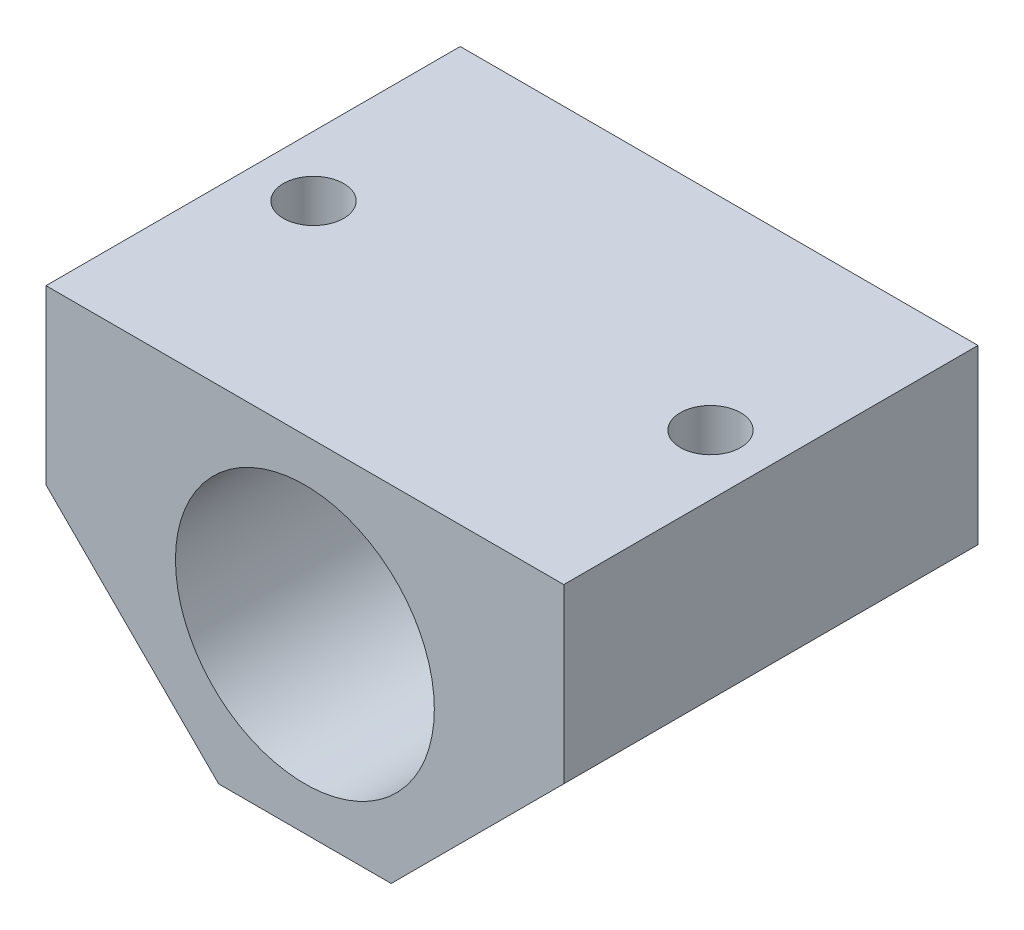
ISO-10303-21;
HEADER;
FILE_DESCRIPTION(('STEP AP214'),'2;1');
FILE_NAME('part.step','',(''),(''),'','','');
FILE_SCHEMA(('AUTOMOTIVE_DESIGN { 1 0 10303 214 1 1 1 1 }'));
ENDSEC;
DATA;
#1=APPLICATION_CONTEXT('core data for automotive mechanical design processes');
#2=APPLICATION_PROTOCOL_DEFINITION('international standard','automotive_design',2000,#1);
#3=PRODUCT_CONTEXT('',#1,'mechanical');
#4=PRODUCT('Part','Part','',(#3));
#5=PRODUCT_RELATED_PRODUCT_CATEGORY('part','',(#4));
#6=PRODUCT_DEFINITION_FORMATION('','',#4);
#7=PRODUCT_DEFINITION_CONTEXT('part definition',#1,'design');
#8=PRODUCT_DEFINITION('design','',#6,#7);
#9=PRODUCT_DEFINITION_SHAPE('','',#8);
#10=(LENGTH_UNIT() NAMED_UNIT(*) SI_UNIT(.MILLI.,.METRE.));
#11=(NAMED_UNIT(*) PLANE_ANGLE_UNIT() SI_UNIT($,.RADIAN.));
#12=(NAMED_UNIT(*) SI_UNIT($,.STERADIAN.) SOLID_ANGLE_UNIT());
#13=UNCERTAINTY_MEASURE_WITH_UNIT(LENGTH_MEASURE(1.E-05),#10,'distance_accuracy_value','');
#14=(GEOMETRIC_REPRESENTATION_CONTEXT(3) GLOBAL_UNCERTAINTY_ASSIGNED_CONTEXT((#13)) GLOBAL_UNIT_ASSIGNED_CONTEXT((#10,
#11,#12)) REPRESENTATION_CONTEXT('',''));
#15=CARTESIAN_POINT('',(0.,0.,0.));
#16=DIRECTION('',(0.,0.,1.));
#17=DIRECTION('',(1.,0.,0.));
#18=AXIS2_PLACEMENT_3D('',#15,#16,#17);
#19=CARTESIAN_POINT('',(0.,0.,24.));
#20=DIRECTION('',(0.,0.,-1.));
#21=DIRECTION('',(-1.,0.,0.));
#22=AXIS2_PLACEMENT_3D('',#19,#20,#21);
#23=PLANE('',#22);
#24=DIRECTION('',(-1.,0.,0.));
#25=VECTOR('',#24,1.);
#26=CARTESIAN_POINT('',(-30.,10.,24.));
#27=LINE('',#26,#25);
#28=CARTESIAN_POINT('',(0.,10.,24.));
#29=VERTEX_POINT('',#28);
#30=CARTESIAN_POINT('',(-30.,10.,24.));
#31=VERTEX_POINT('',#30);
#32=EDGE_CURVE('E242',#29,#31,#27,.T.);
#33=ORIENTED_EDGE('',*,*,#32,.T.);
#34=DIRECTION('',(0.,-1.,0.));
#35=VECTOR('',#34,1.);
#36=CARTESIAN_POINT('',(-30.,0.,24.));
#37=LINE('',#36,#35);
#38=CARTESIAN_POINT('',(-30.,0.,24.));
#39=VERTEX_POINT('',#38);
#40=EDGE_CURVE('E245',#31,#39,#37,.T.);
#41=ORIENTED_EDGE('',*,*,#40,.T.);
#42=DIRECTION('',(0.707106781186548,-0.707106781186547,0.));
#43=VECTOR('',#42,1.);
#44=CARTESIAN_POINT('',(-20.,-10.,24.));
#45=LINE('',#44,#43);
#46=CARTESIAN_POINT('',(-20.,-10.,24.));
#47=VERTEX_POINT('',#46);
#48=EDGE_CURVE('E248',#39,#47,#45,.T.);
#49=ORIENTED_EDGE('',*,*,#48,.T.);
#50=DIRECTION('',(1.,0.,0.));
#51=VECTOR('',#50,1.);
#52=CARTESIAN_POINT('',(-10.,-10.,24.));
#53=LINE('',#52,#51);
#54=CARTESIAN_POINT('',(-10.,-10.,24.));
#55=VERTEX_POINT('',#54);
#56=EDGE_CURVE('E250',#47,#55,#53,.T.);
#57=ORIENTED_EDGE('',*,*,#56,.T.);
#58=DIRECTION('',(0.707106781186548,0.707106781186548,0.));
#59=VECTOR('',#58,1.);
#60=CARTESIAN_POINT('',(0.,0.,24.));
#61=LINE('',#60,#59);
#62=CARTESIAN_POINT('',(0.,0.,24.));
#63=VERTEX_POINT('',#62);
#64=EDGE_CURVE('E252',#55,#63,#61,.T.);
#65=ORIENTED_EDGE('',*,*,#64,.T.);
#66=DIRECTION('',(0.,1.,0.));
#67=VECTOR('',#66,1.);
#68=CARTESIAN_POINT('',(0.,10.,24.));
#69=LINE('',#68,#67);
#70=EDGE_CURVE('E254',#63,#29,#69,.T.);
#71=ORIENTED_EDGE('',*,*,#70,.T.);
#72=EDGE_LOOP('',(#33,#41,#49,#57,#65,#71));
#73=FACE_BOUND('',#72,.T.);
#74=CARTESIAN_POINT('',(-15.,0.,24.));
#75=DIRECTION('',(0.,0.,1.));
#76=DIRECTION('',(1.,0.,0.));
#77=AXIS2_PLACEMENT_3D('',#74,#75,#76);
#78=CIRCLE('',#77,7.5);
#79=CARTESIAN_POINT('',(-7.5,0.,24.));
#80=VERTEX_POINT('',#79);
#81=EDGE_CURVE('E236',#80,#80,#78,.T.);
#82=ORIENTED_EDGE('',*,*,#81,.F.);
#83=EDGE_LOOP('',(#82));
#84=FACE_BOUND('',#83,.T.);
#85=ADVANCED_FACE('F33',(#73,#84),#23,.F.);
#86=CARTESIAN_POINT('',(0.,0.,0.));
#87=DIRECTION('',(0.,0.,-1.));
#88=DIRECTION('',(-1.,0.,0.));
#89=AXIS2_PLACEMENT_3D('',#86,#87,#88);
#90=PLANE('',#89);
#91=DIRECTION('',(-1.,0.,0.));
#92=VECTOR('',#91,1.);
#93=CARTESIAN_POINT('',(-30.,10.,0.));
#94=LINE('',#93,#92);
#95=CARTESIAN_POINT('',(0.,10.,0.));
#96=VERTEX_POINT('',#95);
#97=CARTESIAN_POINT('',(-30.,10.,0.));
#98=VERTEX_POINT('',#97);
#99=EDGE_CURVE('E239',#96,#98,#94,.T.);
#100=ORIENTED_EDGE('',*,*,#99,.F.);
#101=DIRECTION('',(0.,1.,0.));
#102=VECTOR('',#101,1.);
#103=CARTESIAN_POINT('',(0.,10.,0.));
#104=LINE('',#103,#102);
#105=CARTESIAN_POINT('',(0.,0.,0.));
#106=VERTEX_POINT('',#105);
#107=EDGE_CURVE('E246',#106,#96,#104,.T.);
#108=ORIENTED_EDGE('',*,*,#107,.F.);
#109=DIRECTION('',(0.707106781186548,0.707106781186548,0.));
#110=VECTOR('',#109,1.);
#111=CARTESIAN_POINT('',(0.,0.,0.));
#112=LINE('',#111,#110);
#113=CARTESIAN_POINT('',(-10.,-10.,0.));
#114=VERTEX_POINT('',#113);
#115=EDGE_CURVE('E265',#114,#106,#112,.T.);
#116=ORIENTED_EDGE('',*,*,#115,.F.);
#117=DIRECTION('',(1.,0.,0.));
#118=VECTOR('',#117,1.);
#119=CARTESIAN_POINT('',(-10.,-10.,0.));
#120=LINE('',#119,#118);
#121=CARTESIAN_POINT('',(-20.,-10.,0.));
#122=VERTEX_POINT('',#121);
#123=EDGE_CURVE('E263',#122,#114,#120,.T.);
#124=ORIENTED_EDGE('',*,*,#123,.F.);
#125=DIRECTION('',(0.707106781186548,-0.707106781186547,0.));
#126=VECTOR('',#125,1.);
#127=CARTESIAN_POINT('',(-20.,-10.,0.));
#128=LINE('',#127,#126);
#129=CARTESIAN_POINT('',(-30.,0.,0.));
#130=VERTEX_POINT('',#129);
#131=EDGE_CURVE('E261',#130,#122,#128,.T.);
#132=ORIENTED_EDGE('',*,*,#131,.F.);
#133=DIRECTION('',(0.,-1.,0.));
#134=VECTOR('',#133,1.);
#135=CARTESIAN_POINT('',(-30.,0.,0.));
#136=LINE('',#135,#134);
#137=EDGE_CURVE('E259',#98,#130,#136,.T.);
#138=ORIENTED_EDGE('',*,*,#137,.F.);
#139=EDGE_LOOP('',(#100,#108,#116,#124,#132,#138));
#140=FACE_BOUND('',#139,.T.);
#141=CARTESIAN_POINT('',(-15.,0.,0.));
#142=DIRECTION('',(0.,0.,1.));
#143=DIRECTION('',(1.,0.,0.));
#144=AXIS2_PLACEMENT_3D('',#141,#142,#143);
#145=CIRCLE('',#144,7.5);
#146=CARTESIAN_POINT('',(-7.5,0.,0.));
#147=VERTEX_POINT('',#146);
#148=EDGE_CURVE('E235',#147,#147,#145,.T.);
#149=ORIENTED_EDGE('',*,*,#148,.T.);
#150=EDGE_LOOP('',(#149));
#151=FACE_BOUND('',#150,.T.);
#152=ADVANCED_FACE('F341',(#140,#151),#90,.T.);
#153=CARTESIAN_POINT('',(-30.,10.,24.));
#154=DIRECTION('',(0.,-1.,0.));
#155=DIRECTION('',(0.,0.,-1.));
#156=AXIS2_PLACEMENT_3D('',#153,#154,#155);
#157=PLANE('',#156);
#158=CARTESIAN_POINT('',(-3.5,10.,12.));
#159=DIRECTION('',(0.,1.,0.));
#160=DIRECTION('',(0.,0.,1.));
#161=AXIS2_PLACEMENT_3D('',#158,#159,#160);
#162=CIRCLE('',#161,1.75);
#163=CARTESIAN_POINT('',(-3.5,10.,13.75));
#164=VERTEX_POINT('',#163);
#165=EDGE_CURVE('E229',#164,#164,#162,.T.);
#166=ORIENTED_EDGE('',*,*,#165,.F.);
#167=EDGE_LOOP('',(#166));
#168=FACE_BOUND('',#167,.T.);
#169=CARTESIAN_POINT('',(-26.5,10.,12.));
#170=DIRECTION('',(0.,1.,0.));
#171=DIRECTION('',(0.,0.,1.));
#172=AXIS2_PLACEMENT_3D('',#169,#170,#171);
#173=CIRCLE('',#172,1.75);
#174=CARTESIAN_POINT('',(-26.5,10.,13.75));
#175=VERTEX_POINT('',#174);
#176=EDGE_CURVE('E232',#175,#175,#173,.T.);
#177=ORIENTED_EDGE('',*,*,#176,.F.);
#178=EDGE_LOOP('',(#177));
#179=FACE_BOUND('',#178,.T.);
#180=ORIENTED_EDGE('',*,*,#99,.T.);
#181=DIRECTION('',(0.,0.,-1.));
#182=VECTOR('',#181,1.);
#183=CARTESIAN_POINT('',(-30.,10.,24.));
#184=LINE('',#183,#182);
#185=EDGE_CURVE('E282',#31,#98,#184,.T.);
#186=ORIENTED_EDGE('',*,*,#185,.F.);
#187=ORIENTED_EDGE('',*,*,#32,.F.);
#188=DIRECTION('',(0.,0.,-1.));
#189=VECTOR('',#188,1.);
#190=CARTESIAN_POINT('',(0.,10.,24.));
#191=LINE('',#190,#189);
#192=EDGE_CURVE('E256',#29,#96,#191,.T.);
#193=ORIENTED_EDGE('',*,*,#192,.T.);
#194=EDGE_LOOP('',(#180,#186,#187,#193));
#195=FACE_BOUND('',#194,.T.);
#196=ADVANCED_FACE('F35',(#168,#179,#195),#157,.F.);
#197=CARTESIAN_POINT('',(-30.,0.,24.));
#198=DIRECTION('',(1.,0.,0.));
#199=DIRECTION('',(0.,0.,-1.));
#200=AXIS2_PLACEMENT_3D('',#197,#198,#199);
#201=PLANE('',#200);
#202=ORIENTED_EDGE('',*,*,#137,.T.);
#203=DIRECTION('',(0.,0.,-1.));
#204=VECTOR('',#203,1.);
#205=CARTESIAN_POINT('',(-30.,0.,24.));
#206=LINE('',#205,#204);
#207=EDGE_CURVE('E279',#39,#130,#206,.T.);
#208=ORIENTED_EDGE('',*,*,#207,.F.);
#209=ORIENTED_EDGE('',*,*,#40,.F.);
#210=ORIENTED_EDGE('',*,*,#185,.T.);
#211=EDGE_LOOP('',(#202,#208,#209,#210));
#212=FACE_BOUND('',#211,.T.);
#213=ADVANCED_FACE('F367',(#212),#201,.F.);
#214=CARTESIAN_POINT('',(-20.,-10.,24.));
#215=DIRECTION('',(0.707106781186547,0.707106781186548,0.));
#216=DIRECTION('',(-0.707106781186548,0.707106781186547,0.));
#217=AXIS2_PLACEMENT_3D('',#214,#215,#216);
#218=PLANE('',#217);
#219=DIRECTION('',(0.,0.,1.));
#220=VECTOR('',#219,1.);
#221=CARTESIAN_POINT('',(-29.25,-0.749999999999982,24.));
#222=LINE('',#221,#220);
#223=CARTESIAN_POINT('',(-29.25,-0.749999999999997,10.4122867597285));
#224=VERTEX_POINT('',#223);
#225=CARTESIAN_POINT('',(-29.25,-0.749999999999995,13.5877132402715));
#226=VERTEX_POINT('',#225);
#227=EDGE_CURVE('E41',#224,#226,#222,.T.);
#228=ORIENTED_EDGE('',*,*,#227,.T.);
#229=DIRECTION('',(0.654653670707977,-0.654653670707977,0.377964473009227));
#230=VECTOR('',#229,1.);
#231=CARTESIAN_POINT('',(-18.7450557584533,-11.2549442415466,19.6527456259504));
#232=LINE('',#231,#230);
#233=CARTESIAN_POINT('',(-26.5,-3.5,15.1754264805429));
#234=VERTEX_POINT('',#233);
#235=EDGE_CURVE('E11',#226,#234,#232,.T.);
#236=ORIENTED_EDGE('',*,*,#235,.T.);
#237=DIRECTION('',(0.654653670707977,-0.654653670707977,-0.377964473009227));
#238=VECTOR('',#237,1.);
#239=CARTESIAN_POINT('',(-23.1120870986895,-6.8879129013105,13.2194140549803));
#240=LINE('',#239,#238);
#241=CARTESIAN_POINT('',(-23.75,-6.25,13.5877132402715));
#242=VERTEX_POINT('',#241);
#243=EDGE_CURVE('E161',#234,#242,#240,.T.);
#244=ORIENTED_EDGE('',*,*,#243,.T.);
#245=DIRECTION('',(0.,0.,-1.));
#246=VECTOR('',#245,1.);
#247=CARTESIAN_POINT('',(-23.75,-6.25000000000001,24.));
#248=LINE('',#247,#246);
#249=CARTESIAN_POINT('',(-23.75,-6.25,10.4122867597285));
#250=VERTEX_POINT('',#249);
#251=EDGE_CURVE('E308',#242,#250,#248,.T.);
#252=ORIENTED_EDGE('',*,*,#251,.T.);
#253=DIRECTION('',(-0.654653670707977,0.654653670707977,-0.377964473009227));
#254=VECTOR('',#253,1.);
#255=CARTESIAN_POINT('',(-17.1736271870248,-12.8263728129752,14.2091573735911));
#256=LINE('',#255,#254);
#257=CARTESIAN_POINT('',(-26.5,-3.5,8.82457351945706));
#258=VERTEX_POINT('',#257);
#259=EDGE_CURVE('E311',#250,#258,#256,.T.);
#260=ORIENTED_EDGE('',*,*,#259,.T.);
#261=DIRECTION('',(-0.654653670707977,0.654653670707977,0.377964473009227));
#262=VECTOR('',#261,1.);
#263=CARTESIAN_POINT('',(-24.6835156701181,-5.31648432988193,7.77582580262099));
#264=LINE('',#263,#262);
#265=EDGE_CURVE('E314',#258,#224,#264,.T.);
#266=ORIENTED_EDGE('',*,*,#265,.T.);
#267=EDGE_LOOP('',(#228,#236,#244,#252,#260,#266));
#268=FACE_BOUND('',#267,.T.);
#269=ORIENTED_EDGE('',*,*,#131,.T.);
#270=DIRECTION('',(0.,0.,-1.));
#271=VECTOR('',#270,1.);
#272=CARTESIAN_POINT('',(-20.,-10.,24.));
#273=LINE('',#272,#271);
#274=EDGE_CURVE('E276',#47,#122,#273,.T.);
#275=ORIENTED_EDGE('',*,*,#274,.F.);
#276=ORIENTED_EDGE('',*,*,#48,.F.);
#277=ORIENTED_EDGE('',*,*,#207,.T.);
#278=EDGE_LOOP('',(#269,#275,#276,#277));
#279=FACE_BOUND('',#278,.T.);
#280=ADVANCED_FACE('F318',(#268,#279),#218,.F.);
#281=CARTESIAN_POINT('',(-10.,-10.,24.));
#282=DIRECTION('',(0.,1.,0.));
#283=DIRECTION('',(0.,0.,1.));
#284=AXIS2_PLACEMENT_3D('',#281,#282,#283);
#285=PLANE('',#284);
#286=ORIENTED_EDGE('',*,*,#123,.T.);
#287=DIRECTION('',(0.,0.,-1.));
#288=VECTOR('',#287,1.);
#289=CARTESIAN_POINT('',(-10.,-10.,24.));
#290=LINE('',#289,#288);
#291=EDGE_CURVE('E273',#55,#114,#290,.T.);
#292=ORIENTED_EDGE('',*,*,#291,.F.);
#293=ORIENTED_EDGE('',*,*,#56,.F.);
#294=ORIENTED_EDGE('',*,*,#274,.T.);
#295=EDGE_LOOP('',(#286,#292,#293,#294));
#296=FACE_BOUND('',#295,.T.);
#297=ADVANCED_FACE('F361',(#296),#285,.F.);
#298=CARTESIAN_POINT('',(0.,0.,24.));
#299=DIRECTION('',(-0.707106781186547,0.707106781186547,0.));
#300=DIRECTION('',(-0.707106781186548,-0.707106781186548,0.));
#301=AXIS2_PLACEMENT_3D('',#298,#299,#300);
#302=PLANE('',#301);
#303=DIRECTION('',(0.,0.,1.));
#304=VECTOR('',#303,1.);
#305=CARTESIAN_POINT('',(-6.25,-6.25,24.));
#306=LINE('',#305,#304);
#307=CARTESIAN_POINT('',(-6.25,-6.25,10.4122867597285));
#308=VERTEX_POINT('',#307);
#309=CARTESIAN_POINT('',(-6.25,-6.25,13.5877132402715));
#310=VERTEX_POINT('',#309);
#311=EDGE_CURVE('E299',#308,#310,#306,.T.);
#312=ORIENTED_EDGE('',*,*,#311,.T.);
#313=DIRECTION('',(0.654653670707977,0.654653670707977,0.377964473009228));
#314=VECTOR('',#313,1.);
#315=CARTESIAN_POINT('',(1.68351567011808,1.68351567011808,18.1681306480343));
#316=LINE('',#315,#314);
#317=CARTESIAN_POINT('',(-3.5,-3.5,15.1754264805429));
#318=VERTEX_POINT('',#317);
#319=EDGE_CURVE('E302',#310,#318,#316,.T.);
#320=ORIENTED_EDGE('',*,*,#319,.T.);
#321=DIRECTION('',(0.654653670707977,0.654653670707977,-0.377964473009227));
#322=VECTOR('',#321,1.);
#323=CARTESIAN_POINT('',(-2.68351567011808,-2.68351567011808,14.7040290328965));
#324=LINE('',#323,#322);
#325=CARTESIAN_POINT('',(-0.75,-0.75,13.5877132402715));
#326=VERTEX_POINT('',#325);
#327=EDGE_CURVE('E285',#318,#326,#324,.T.);
#328=ORIENTED_EDGE('',*,*,#327,.T.);
#329=DIRECTION('',(0.,0.,-1.));
#330=VECTOR('',#329,1.);
#331=CARTESIAN_POINT('',(-0.749999999999998,-0.749999999999998,24.));
#332=LINE('',#331,#330);
#333=CARTESIAN_POINT('',(-0.75,-0.75,10.4122867597285));
#334=VERTEX_POINT('',#333);
#335=EDGE_CURVE('E290',#326,#334,#332,.T.);
#336=ORIENTED_EDGE('',*,*,#335,.T.);
#337=DIRECTION('',(-0.654653670707977,-0.654653670707977,-0.377964473009227));
#338=VECTOR('',#337,1.);
#339=CARTESIAN_POINT('',(3.25494424154665,3.25494424154665,12.7245423956749));
#340=LINE('',#339,#338);
#341=CARTESIAN_POINT('',(-3.5,-3.5,8.82457351945706));
#342=VERTEX_POINT('',#341);
#343=EDGE_CURVE('E293',#334,#342,#340,.T.);
#344=ORIENTED_EDGE('',*,*,#343,.T.);
#345=DIRECTION('',(-0.654653670707977,-0.654653670707977,0.377964473009227));
#346=VECTOR('',#345,1.);
#347=CARTESIAN_POINT('',(-4.25494424154665,-4.25494424154665,9.26044078053717));
#348=LINE('',#347,#346);
#349=EDGE_CURVE('E296',#342,#308,#348,.T.);
#350=ORIENTED_EDGE('',*,*,#349,.T.);
#351=EDGE_LOOP('',(#312,#320,#328,#336,#344,#350));
#352=FACE_BOUND('',#351,.T.);
#353=ORIENTED_EDGE('',*,*,#115,.T.);
#354=DIRECTION('',(0.,0.,-1.));
#355=VECTOR('',#354,1.);
#356=CARTESIAN_POINT('',(0.,0.,24.));
#357=LINE('',#356,#355);
#358=EDGE_CURVE('E270',#63,#106,#357,.T.);
#359=ORIENTED_EDGE('',*,*,#358,.F.);
#360=ORIENTED_EDGE('',*,*,#64,.F.);
#361=ORIENTED_EDGE('',*,*,#291,.T.);
#362=EDGE_LOOP('',(#353,#359,#360,#361));
#363=FACE_BOUND('',#362,.T.);
#364=ADVANCED_FACE('F357',(#352,#363),#302,.F.);
#365=CARTESIAN_POINT('',(0.,10.,24.));
#366=DIRECTION('',(-1.,0.,0.));
#367=DIRECTION('',(0.,-1.,0.));
#368=AXIS2_PLACEMENT_3D('',#365,#366,#367);
#369=PLANE('',#368);
#370=ORIENTED_EDGE('',*,*,#107,.T.);
#371=ORIENTED_EDGE('',*,*,#192,.F.);
#372=ORIENTED_EDGE('',*,*,#70,.F.);
#373=ORIENTED_EDGE('',*,*,#358,.T.);
#374=EDGE_LOOP('',(#370,#371,#372,#373));
#375=FACE_BOUND('',#374,.T.);
#376=ADVANCED_FACE('F354',(#375),#369,.F.);
#377=CARTESIAN_POINT('',(-15.,0.,24.));
#378=DIRECTION('',(0.,0.,-1.));
#379=DIRECTION('',(-1.,0.,0.));
#380=AXIS2_PLACEMENT_3D('',#377,#378,#379);
#381=CYLINDRICAL_SURFACE('',#380,7.5);
#382=ORIENTED_EDGE('',*,*,#81,.T.);
#383=EDGE_LOOP('',(#382));
#384=FACE_BOUND('',#383,.T.);
#385=ORIENTED_EDGE('',*,*,#148,.F.);
#386=EDGE_LOOP('',(#385));
#387=FACE_BOUND('',#386,.T.);
#388=ADVANCED_FACE('F351',(#384,#387),#381,.F.);
#389=CARTESIAN_POINT('',(-26.5,-14.,12.));
#390=DIRECTION('',(0.,1.,0.));
#391=DIRECTION('',(0.,0.,1.));
#392=AXIS2_PLACEMENT_3D('',#389,#390,#391);
#393=CYLINDRICAL_SURFACE('',#392,1.75);
#394=CARTESIAN_POINT('',(-26.5,0.,12.));
#395=DIRECTION('',(0.,1.,0.));
#396=DIRECTION('',(0.,0.,1.));
#397=AXIS2_PLACEMENT_3D('',#394,#395,#396);
#398=CIRCLE('',#397,1.75);
#399=CARTESIAN_POINT('',(-26.5,0.,13.75));
#400=VERTEX_POINT('',#399);
#401=EDGE_CURVE('E192',#400,#400,#398,.F.);
#402=ORIENTED_EDGE('',*,*,#401,.T.);
#403=EDGE_LOOP('',(#402));
#404=FACE_BOUND('',#403,.T.);
#405=ORIENTED_EDGE('',*,*,#176,.T.);
#406=EDGE_LOOP('',(#405));
#407=FACE_BOUND('',#406,.T.);
#408=ADVANCED_FACE('F396',(#404,#407),#393,.F.);
#409=CARTESIAN_POINT('',(-3.5,-14.,12.));
#410=DIRECTION('',(0.,1.,0.));
#411=DIRECTION('',(0.,0.,1.));
#412=AXIS2_PLACEMENT_3D('',#409,#410,#411);
#413=CYLINDRICAL_SURFACE('',#412,1.75);
#414=CARTESIAN_POINT('',(-3.5,0.,12.));
#415=DIRECTION('',(0.,1.,0.));
#416=DIRECTION('',(0.,0.,1.));
#417=AXIS2_PLACEMENT_3D('',#414,#415,#416);
#418=CIRCLE('',#417,1.75);
#419=CARTESIAN_POINT('',(-3.5,0.,13.75));
#420=VERTEX_POINT('',#419);
#421=EDGE_CURVE('E220',#420,#420,#418,.F.);
#422=ORIENTED_EDGE('',*,*,#421,.T.);
#423=EDGE_LOOP('',(#422));
#424=FACE_BOUND('',#423,.T.);
#425=ORIENTED_EDGE('',*,*,#165,.T.);
#426=EDGE_LOOP('',(#425));
#427=FACE_BOUND('',#426,.T.);
#428=ADVANCED_FACE('F401',(#424,#427),#413,.F.);
#429=CARTESIAN_POINT('',(-6.25,-7.,13.5877132402715));
#430=DIRECTION('',(-0.5,0.,0.866025403784438));
#431=DIRECTION('',(0.866025403784438,0.,0.5));
#432=AXIS2_PLACEMENT_3D('',#429,#430,#431);
#433=PLANE('',#432);
#434=DIRECTION('',(0.,1.,0.));
#435=VECTOR('',#434,1.);
#436=CARTESIAN_POINT('',(-6.25,-7.,13.5877132402715));
#437=LINE('',#436,#435);
#438=CARTESIAN_POINT('',(-6.25,0.,13.5877132402715));
#439=VERTEX_POINT('',#438);
#440=EDGE_CURVE('E218',#310,#439,#437,.T.);
#441=ORIENTED_EDGE('',*,*,#440,.T.);
#442=DIRECTION('',(0.866025403784438,0.,0.5));
#443=VECTOR('',#442,1.);
#444=CARTESIAN_POINT('',(-6.25,0.,13.5877132402715));
#445=LINE('',#444,#443);
#446=CARTESIAN_POINT('',(-3.5,0.,15.1754264805429));
#447=VERTEX_POINT('',#446);
#448=EDGE_CURVE('E200',#439,#447,#445,.T.);
#449=ORIENTED_EDGE('',*,*,#448,.T.);
#450=DIRECTION('',(0.,1.,0.));
#451=VECTOR('',#450,1.);
#452=CARTESIAN_POINT('',(-3.5,-7.,15.1754264805429));
#453=LINE('',#452,#451);
#454=EDGE_CURVE('E217',#318,#447,#453,.T.);
#455=ORIENTED_EDGE('',*,*,#454,.F.);
#456=ORIENTED_EDGE('',*,*,#319,.F.);
#457=EDGE_LOOP('',(#441,#449,#455,#456));
#458=FACE_BOUND('',#457,.T.);
#459=ADVANCED_FACE('F407',(#458),#433,.F.);
#460=CARTESIAN_POINT('',(-6.25,-7.,10.4122867597285));
#461=DIRECTION('',(-1.,0.,0.));
#462=DIRECTION('',(0.,0.,1.));
#463=AXIS2_PLACEMENT_3D('',#460,#461,#462);
#464=PLANE('',#463);
#465=DIRECTION('',(0.,1.,0.));
#466=VECTOR('',#465,1.);
#467=CARTESIAN_POINT('',(-6.25,-7.,10.4122867597285));
#468=LINE('',#467,#466);
#469=CARTESIAN_POINT('',(-6.25,0.,10.4122867597285));
#470=VERTEX_POINT('',#469);
#471=EDGE_CURVE('E221',#308,#470,#468,.T.);
#472=ORIENTED_EDGE('',*,*,#471,.T.);
#473=DIRECTION('',(0.,0.,1.));
#474=VECTOR('',#473,1.);
#475=CARTESIAN_POINT('',(-6.25,0.,10.4122867597285));
#476=LINE('',#475,#474);
#477=EDGE_CURVE('E214',#470,#439,#476,.T.);
#478=ORIENTED_EDGE('',*,*,#477,.T.);
#479=ORIENTED_EDGE('',*,*,#440,.F.);
#480=ORIENTED_EDGE('',*,*,#311,.F.);
#481=EDGE_LOOP('',(#472,#478,#479,#480));
#482=FACE_BOUND('',#481,.T.);
#483=ADVANCED_FACE('F414',(#482),#464,.F.);
#484=CARTESIAN_POINT('',(-3.5,-7.,8.82457351945706));
#485=DIRECTION('',(-0.5,0.,-0.866025403784439));
#486=DIRECTION('',(-0.866025403784439,0.,0.5));
#487=AXIS2_PLACEMENT_3D('',#484,#485,#486);
#488=PLANE('',#487);
#489=DIRECTION('',(0.,1.,0.));
#490=VECTOR('',#489,1.);
#491=CARTESIAN_POINT('',(-3.5,-7.,8.82457351945706));
#492=LINE('',#491,#490);
#493=CARTESIAN_POINT('',(-3.5,0.,8.82457351945706));
#494=VERTEX_POINT('',#493);
#495=EDGE_CURVE('E223',#342,#494,#492,.T.);
#496=ORIENTED_EDGE('',*,*,#495,.T.);
#497=DIRECTION('',(-0.866025403784439,0.,0.5));
#498=VECTOR('',#497,1.);
#499=CARTESIAN_POINT('',(-3.5,0.,8.82457351945706));
#500=LINE('',#499,#498);
#501=EDGE_CURVE('E211',#494,#470,#500,.T.);
#502=ORIENTED_EDGE('',*,*,#501,.T.);
#503=ORIENTED_EDGE('',*,*,#471,.F.);
#504=ORIENTED_EDGE('',*,*,#349,.F.);
#505=EDGE_LOOP('',(#496,#502,#503,#504));
#506=FACE_BOUND('',#505,.T.);
#507=ADVANCED_FACE('F427',(#506),#488,.F.);
#508=CARTESIAN_POINT('',(-0.75,-7.,10.4122867597285));
#509=DIRECTION('',(0.5,0.,-0.866025403784439));
#510=DIRECTION('',(-0.866025403784439,0.,-0.5));
#511=AXIS2_PLACEMENT_3D('',#508,#509,#510);
#512=PLANE('',#511);
#513=DIRECTION('',(0.,1.,0.));
#514=VECTOR('',#513,1.);
#515=CARTESIAN_POINT('',(-0.75,-7.,10.4122867597285));
#516=LINE('',#515,#514);
#517=CARTESIAN_POINT('',(-0.75,0.,10.4122867597285));
#518=VERTEX_POINT('',#517);
#519=EDGE_CURVE('E225',#334,#518,#516,.T.);
#520=ORIENTED_EDGE('',*,*,#519,.T.);
#521=DIRECTION('',(-0.866025403784439,0.,-0.5));
#522=VECTOR('',#521,1.);
#523=CARTESIAN_POINT('',(-0.75,0.,10.4122867597285));
#524=LINE('',#523,#522);
#525=EDGE_CURVE('E208',#518,#494,#524,.T.);
#526=ORIENTED_EDGE('',*,*,#525,.T.);
#527=ORIENTED_EDGE('',*,*,#495,.F.);
#528=ORIENTED_EDGE('',*,*,#343,.F.);
#529=EDGE_LOOP('',(#520,#526,#527,#528));
#530=FACE_BOUND('',#529,.T.);
#531=ADVANCED_FACE('F423',(#530),#512,.F.);
#532=CARTESIAN_POINT('',(-0.75,-7.,13.5877132402715));
#533=DIRECTION('',(1.,0.,0.));
#534=DIRECTION('',(0.,0.,-1.));
#535=AXIS2_PLACEMENT_3D('',#532,#533,#534);
#536=PLANE('',#535);
#537=DIRECTION('',(0.,1.,0.));
#538=VECTOR('',#537,1.);
#539=CARTESIAN_POINT('',(-0.75,-7.,13.5877132402715));
#540=LINE('',#539,#538);
#541=CARTESIAN_POINT('',(-0.75,0.,13.5877132402715));
#542=VERTEX_POINT('',#541);
#543=EDGE_CURVE('E56',#326,#542,#540,.T.);
#544=ORIENTED_EDGE('',*,*,#543,.T.);
#545=DIRECTION('',(0.,0.,-1.));
#546=VECTOR('',#545,1.);
#547=CARTESIAN_POINT('',(-0.75,0.,13.5877132402715));
#548=LINE('',#547,#546);
#549=EDGE_CURVE('E205',#542,#518,#548,.T.);
#550=ORIENTED_EDGE('',*,*,#549,.T.);
#551=ORIENTED_EDGE('',*,*,#519,.F.);
#552=ORIENTED_EDGE('',*,*,#335,.F.);
#553=EDGE_LOOP('',(#544,#550,#551,#552));
#554=FACE_BOUND('',#553,.T.);
#555=ADVANCED_FACE('F420',(#554),#536,.F.);
#556=CARTESIAN_POINT('',(-3.5,-7.,15.1754264805429));
#557=DIRECTION('',(0.5,0.,0.866025403784439));
#558=DIRECTION('',(0.866025403784439,0.,-0.5));
#559=AXIS2_PLACEMENT_3D('',#556,#557,#558);
#560=PLANE('',#559);
#561=ORIENTED_EDGE('',*,*,#454,.T.);
#562=DIRECTION('',(0.866025403784439,0.,-0.5));
#563=VECTOR('',#562,1.);
#564=CARTESIAN_POINT('',(-3.5,0.,15.1754264805429));
#565=LINE('',#564,#563);
#566=EDGE_CURVE('E203',#447,#542,#565,.T.);
#567=ORIENTED_EDGE('',*,*,#566,.T.);
#568=ORIENTED_EDGE('',*,*,#543,.F.);
#569=ORIENTED_EDGE('',*,*,#327,.F.);
#570=EDGE_LOOP('',(#561,#567,#568,#569));
#571=FACE_BOUND('',#570,.T.);
#572=ADVANCED_FACE('F416',(#571),#560,.F.);
#573=CARTESIAN_POINT('',(0.,0.,0.));
#574=DIRECTION('',(0.,1.,0.));
#575=DIRECTION('',(0.,0.,1.));
#576=AXIS2_PLACEMENT_3D('',#573,#574,#575);
#577=PLANE('',#576);
#578=ORIENTED_EDGE('',*,*,#448,.F.);
#579=ORIENTED_EDGE('',*,*,#477,.F.);
#580=ORIENTED_EDGE('',*,*,#501,.F.);
#581=ORIENTED_EDGE('',*,*,#525,.F.);
#582=ORIENTED_EDGE('',*,*,#549,.F.);
#583=ORIENTED_EDGE('',*,*,#566,.F.);
#584=EDGE_LOOP('',(#578,#579,#580,#581,#582,#583));
#585=FACE_BOUND('',#584,.T.);
#586=ORIENTED_EDGE('',*,*,#421,.F.);
#587=EDGE_LOOP('',(#586));
#588=FACE_BOUND('',#587,.T.);
#589=ADVANCED_FACE('F419',(#585,#588),#577,.F.);
#590=CARTESIAN_POINT('',(-29.25,-7.,13.5877132402715));
#591=DIRECTION('',(-0.5,0.,0.866025403784439));
#592=DIRECTION('',(0.866025403784439,0.,0.5));
#593=AXIS2_PLACEMENT_3D('',#590,#591,#592);
#594=PLANE('',#593);
#595=DIRECTION('',(0.,1.,0.));
#596=VECTOR('',#595,1.);
#597=CARTESIAN_POINT('',(-29.25,-7.,13.5877132402715));
#598=LINE('',#597,#596);
#599=CARTESIAN_POINT('',(-29.25,0.,13.5877132402715));
#600=VERTEX_POINT('',#599);
#601=EDGE_CURVE('E180',#226,#600,#598,.T.);
#602=ORIENTED_EDGE('',*,*,#601,.T.);
#603=DIRECTION('',(0.866025403784439,0.,0.5));
#604=VECTOR('',#603,1.);
#605=CARTESIAN_POINT('',(-29.25,0.,13.5877132402715));
#606=LINE('',#605,#604);
#607=CARTESIAN_POINT('',(-26.5,0.,15.1754264805429));
#608=VERTEX_POINT('',#607);
#609=EDGE_CURVE('E172',#600,#608,#606,.T.);
#610=ORIENTED_EDGE('',*,*,#609,.T.);
#611=DIRECTION('',(0.,1.,0.));
#612=VECTOR('',#611,1.);
#613=CARTESIAN_POINT('',(-26.5,-7.,15.1754264805429));
#614=LINE('',#613,#612);
#615=EDGE_CURVE('E156',#234,#608,#614,.T.);
#616=ORIENTED_EDGE('',*,*,#615,.F.);
#617=ORIENTED_EDGE('',*,*,#235,.F.);
#618=EDGE_LOOP('',(#602,#610,#616,#617));
#619=FACE_BOUND('',#618,.T.);
#620=ADVANCED_FACE('F178',(#619),#594,.F.);
#621=CARTESIAN_POINT('',(-29.25,-7.,10.4122867597285));
#622=DIRECTION('',(-1.,0.,0.));
#623=DIRECTION('',(0.,0.,1.));
#624=AXIS2_PLACEMENT_3D('',#621,#622,#623);
#625=PLANE('',#624);
#626=DIRECTION('',(0.,1.,0.));
#627=VECTOR('',#626,1.);
#628=CARTESIAN_POINT('',(-29.25,-7.,10.4122867597285));
#629=LINE('',#628,#627);
#630=CARTESIAN_POINT('',(-29.25,0.,10.4122867597285));
#631=VERTEX_POINT('',#630);
#632=EDGE_CURVE('E193',#224,#631,#629,.T.);
#633=ORIENTED_EDGE('',*,*,#632,.T.);
#634=DIRECTION('',(0.,0.,1.));
#635=VECTOR('',#634,1.);
#636=CARTESIAN_POINT('',(-29.25,0.,10.4122867597285));
#637=LINE('',#636,#635);
#638=EDGE_CURVE('E164',#631,#600,#637,.T.);
#639=ORIENTED_EDGE('',*,*,#638,.T.);
#640=ORIENTED_EDGE('',*,*,#601,.F.);
#641=ORIENTED_EDGE('',*,*,#227,.F.);
#642=EDGE_LOOP('',(#633,#639,#640,#641));
#643=FACE_BOUND('',#642,.T.);
#644=ADVANCED_FACE('F322',(#643),#625,.F.);
#645=CARTESIAN_POINT('',(-26.5,-7.,8.82457351945706));
#646=DIRECTION('',(-0.5,0.,-0.866025403784439));
#647=DIRECTION('',(-0.866025403784439,0.,0.5));
#648=AXIS2_PLACEMENT_3D('',#645,#646,#647);
#649=PLANE('',#648);
#650=DIRECTION('',(0.,1.,0.));
#651=VECTOR('',#650,1.);
#652=CARTESIAN_POINT('',(-26.5,-7.,8.82457351945706));
#653=LINE('',#652,#651);
#654=CARTESIAN_POINT('',(-26.5,0.,8.82457351945706));
#655=VERTEX_POINT('',#654);
#656=EDGE_CURVE('E195',#258,#655,#653,.T.);
#657=ORIENTED_EDGE('',*,*,#656,.T.);
#658=DIRECTION('',(-0.866025403784439,0.,0.5));
#659=VECTOR('',#658,1.);
#660=CARTESIAN_POINT('',(-26.5,0.,8.82457351945706));
#661=LINE('',#660,#659);
#662=EDGE_CURVE('E187',#655,#631,#661,.T.);
#663=ORIENTED_EDGE('',*,*,#662,.T.);
#664=ORIENTED_EDGE('',*,*,#632,.F.);
#665=ORIENTED_EDGE('',*,*,#265,.F.);
#666=EDGE_LOOP('',(#657,#663,#664,#665));
#667=FACE_BOUND('',#666,.T.);
#668=ADVANCED_FACE('F324',(#667),#649,.F.);
#669=CARTESIAN_POINT('',(-23.75,-7.,10.4122867597285));
#670=DIRECTION('',(0.5,0.,-0.866025403784438));
#671=DIRECTION('',(-0.866025403784439,0.,-0.5));
#672=AXIS2_PLACEMENT_3D('',#669,#670,#671);
#673=PLANE('',#672);
#674=DIRECTION('',(0.,1.,0.));
#675=VECTOR('',#674,1.);
#676=CARTESIAN_POINT('',(-23.75,-7.,10.4122867597285));
#677=LINE('',#676,#675);
#678=CARTESIAN_POINT('',(-23.75,0.,10.4122867597285));
#679=VERTEX_POINT('',#678);
#680=EDGE_CURVE('E197',#250,#679,#677,.T.);
#681=ORIENTED_EDGE('',*,*,#680,.T.);
#682=DIRECTION('',(-0.866025403784439,0.,-0.5));
#683=VECTOR('',#682,1.);
#684=CARTESIAN_POINT('',(-23.75,0.,10.4122867597285));
#685=LINE('',#684,#683);
#686=EDGE_CURVE('E184',#679,#655,#685,.T.);
#687=ORIENTED_EDGE('',*,*,#686,.T.);
#688=ORIENTED_EDGE('',*,*,#656,.F.);
#689=ORIENTED_EDGE('',*,*,#259,.F.);
#690=EDGE_LOOP('',(#681,#687,#688,#689));
#691=FACE_BOUND('',#690,.T.);
#692=ADVANCED_FACE('F328',(#691),#673,.F.);
#693=CARTESIAN_POINT('',(-23.75,-7.,13.5877132402715));
#694=DIRECTION('',(1.,0.,0.));
#695=DIRECTION('',(0.,0.,-1.));
#696=AXIS2_PLACEMENT_3D('',#693,#694,#695);
#697=PLANE('',#696);
#698=DIRECTION('',(0.,1.,0.));
#699=VECTOR('',#698,1.);
#700=CARTESIAN_POINT('',(-23.75,-7.,13.5877132402715));
#701=LINE('',#700,#699);
#702=CARTESIAN_POINT('',(-23.75,0.,13.5877132402715));
#703=VERTEX_POINT('',#702);
#704=EDGE_CURVE('E48',#242,#703,#701,.T.);
#705=ORIENTED_EDGE('',*,*,#704,.T.);
#706=DIRECTION('',(0.,0.,-1.));
#707=VECTOR('',#706,1.);
#708=CARTESIAN_POINT('',(-23.75,0.,13.5877132402715));
#709=LINE('',#708,#707);
#710=EDGE_CURVE('E176',#703,#679,#709,.T.);
#711=ORIENTED_EDGE('',*,*,#710,.T.);
#712=ORIENTED_EDGE('',*,*,#680,.F.);
#713=ORIENTED_EDGE('',*,*,#251,.F.);
#714=EDGE_LOOP('',(#705,#711,#712,#713));
#715=FACE_BOUND('',#714,.T.);
#716=ADVANCED_FACE('F331',(#715),#697,.F.);
#717=CARTESIAN_POINT('',(-26.5,-7.,15.1754264805429));
#718=DIRECTION('',(0.5,0.,0.866025403784439));
#719=DIRECTION('',(0.866025403784439,0.,-0.5));
#720=AXIS2_PLACEMENT_3D('',#717,#718,#719);
#721=PLANE('',#720);
#722=ORIENTED_EDGE('',*,*,#615,.T.);
#723=DIRECTION('',(0.866025403784439,0.,-0.5));
#724=VECTOR('',#723,1.);
#725=CARTESIAN_POINT('',(-26.5,0.,15.1754264805429));
#726=LINE('',#725,#724);
#727=EDGE_CURVE('E159',#608,#703,#726,.T.);
#728=ORIENTED_EDGE('',*,*,#727,.T.);
#729=ORIENTED_EDGE('',*,*,#704,.F.);
#730=ORIENTED_EDGE('',*,*,#243,.F.);
#731=EDGE_LOOP('',(#722,#728,#729,#730));
#732=FACE_BOUND('',#731,.T.);
#733=ADVANCED_FACE('F158',(#732),#721,.F.);
#734=CARTESIAN_POINT('',(0.,0.,0.));
#735=DIRECTION('',(0.,1.,0.));
#736=DIRECTION('',(0.,0.,1.));
#737=AXIS2_PLACEMENT_3D('',#734,#735,#736);
#738=PLANE('',#737);
#739=ORIENTED_EDGE('',*,*,#609,.F.);
#740=ORIENTED_EDGE('',*,*,#638,.F.);
#741=ORIENTED_EDGE('',*,*,#662,.F.);
#742=ORIENTED_EDGE('',*,*,#686,.F.);
#743=ORIENTED_EDGE('',*,*,#710,.F.);
#744=ORIENTED_EDGE('',*,*,#727,.F.);
#745=EDGE_LOOP('',(#739,#740,#741,#742,#743,#744));
#746=FACE_BOUND('',#745,.T.);
#747=ORIENTED_EDGE('',*,*,#401,.F.);
#748=EDGE_LOOP('',(#747));
#749=FACE_BOUND('',#748,.T.);
#750=ADVANCED_FACE('F169',(#746,#749),#738,.F.);
#751=CLOSED_SHELL('',(#85,#152,#196,#213,#280,#297,#364,#376,#388,#408,#428,#459,#483,#507,#531,
#555,#572,#589,#620,#644,#668,#692,#716,#733,#750));
#752=MANIFOLD_SOLID_BREP('B2',#751);
#753=ADVANCED_BREP_SHAPE_REPRESENTATION('',(#18,#752),#14);
#754=SHAPE_DEFINITION_REPRESENTATION(#9,#753);
ENDSEC;
END-ISO-10303-21;
